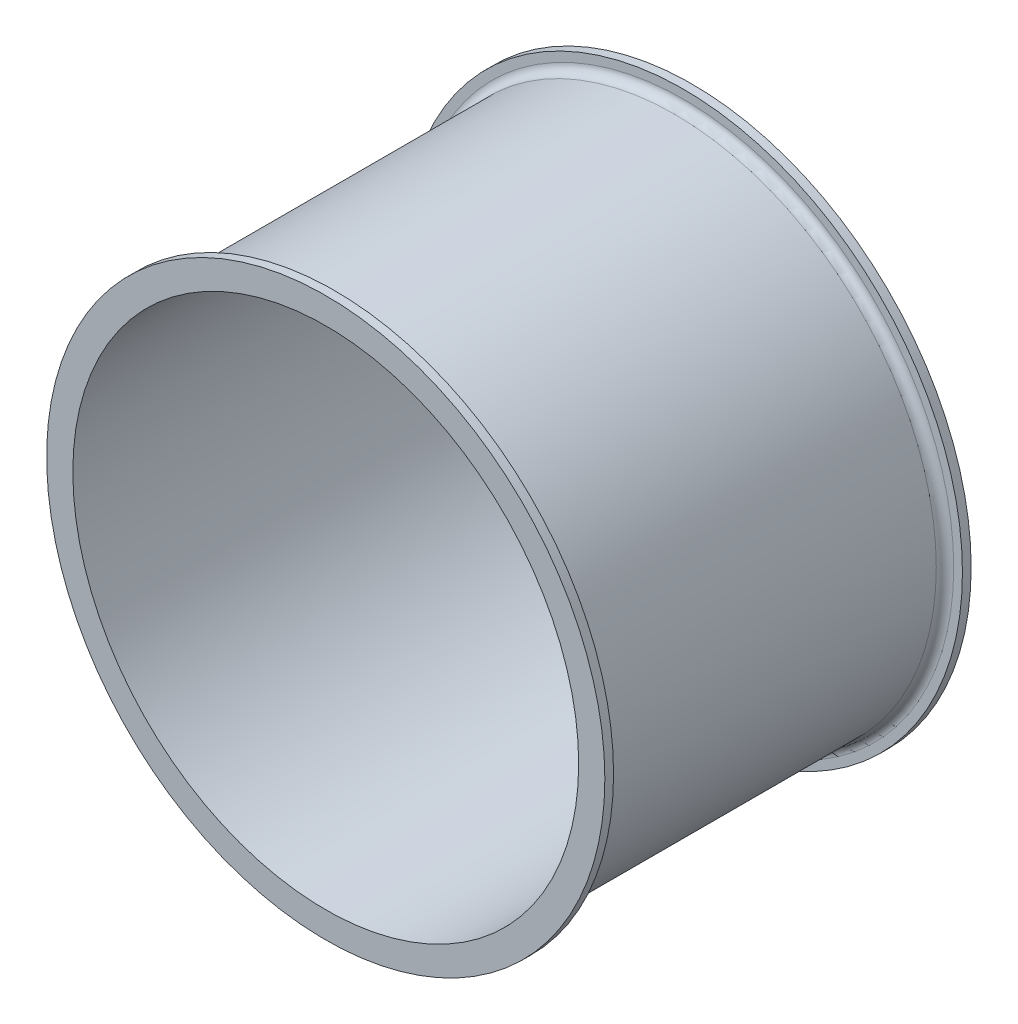
ISO-10303-21;
HEADER;
FILE_DESCRIPTION(('STEP AP214'),'2;1');
FILE_NAME('part.step','',(''),(''),'','','');
FILE_SCHEMA(('AUTOMOTIVE_DESIGN { 1 0 10303 214 1 1 1 1 }'));
ENDSEC;
DATA;
#1=APPLICATION_CONTEXT('core data for automotive mechanical design processes');
#2=APPLICATION_PROTOCOL_DEFINITION('international standard','automotive_design',2000,#1);
#3=PRODUCT_CONTEXT('',#1,'mechanical');
#4=PRODUCT('Part','Part','',(#3));
#5=PRODUCT_RELATED_PRODUCT_CATEGORY('part','',(#4));
#6=PRODUCT_DEFINITION_FORMATION('','',#4);
#7=PRODUCT_DEFINITION_CONTEXT('part definition',#1,'design');
#8=PRODUCT_DEFINITION('design','',#6,#7);
#9=PRODUCT_DEFINITION_SHAPE('','',#8);
#10=(LENGTH_UNIT() NAMED_UNIT(*) SI_UNIT(.MILLI.,.METRE.));
#11=(NAMED_UNIT(*) PLANE_ANGLE_UNIT() SI_UNIT($,.RADIAN.));
#12=(NAMED_UNIT(*) SI_UNIT($,.STERADIAN.) SOLID_ANGLE_UNIT());
#13=UNCERTAINTY_MEASURE_WITH_UNIT(LENGTH_MEASURE(1.E-05),#10,'distance_accuracy_value','');
#14=(GEOMETRIC_REPRESENTATION_CONTEXT(3) GLOBAL_UNCERTAINTY_ASSIGNED_CONTEXT((#13)) GLOBAL_UNIT_ASSIGNED_CONTEXT((#10,
#11,#12)) REPRESENTATION_CONTEXT('',''));
#15=CARTESIAN_POINT('',(0.,0.,0.));
#16=DIRECTION('',(0.,0.,1.));
#17=DIRECTION('',(1.,0.,0.));
#18=AXIS2_PLACEMENT_3D('',#15,#16,#17);
#19=CARTESIAN_POINT('',(0.,0.,5.));
#20=DIRECTION('',(0.,0.,-1.));
#21=DIRECTION('',(-1.,0.,0.));
#22=AXIS2_PLACEMENT_3D('',#19,#20,#21);
#23=CYLINDRICAL_SURFACE('',#22,160.);
#24=CARTESIAN_POINT('',(0.,0.,5.));
#25=DIRECTION('',(0.,0.,1.));
#26=DIRECTION('',(1.,0.,0.));
#27=AXIS2_PLACEMENT_3D('',#24,#25,#26);
#28=CIRCLE('',#27,160.);
#29=CARTESIAN_POINT('',(160.,0.,5.));
#30=VERTEX_POINT('',#29);
#31=EDGE_CURVE('E50',#30,#30,#28,.T.);
#32=ORIENTED_EDGE('',*,*,#31,.F.);
#33=EDGE_LOOP('',(#32));
#34=FACE_BOUND('',#33,.T.);
#35=CARTESIAN_POINT('',(0.,0.,0.));
#36=DIRECTION('',(0.,0.,1.));
#37=DIRECTION('',(1.,0.,0.));
#38=AXIS2_PLACEMENT_3D('',#35,#36,#37);
#39=CIRCLE('',#38,160.);
#40=CARTESIAN_POINT('',(160.,0.,0.));
#41=VERTEX_POINT('',#40);
#42=EDGE_CURVE('E51',#41,#41,#39,.T.);
#43=ORIENTED_EDGE('',*,*,#42,.T.);
#44=EDGE_LOOP('',(#43));
#45=FACE_BOUND('',#44,.T.);
#46=ADVANCED_FACE('F30',(#34,#45),#23,.T.);
#47=CARTESIAN_POINT('',(0.,0.,5.));
#48=DIRECTION('',(0.,0.,1.));
#49=DIRECTION('',(1.,0.,0.));
#50=AXIS2_PLACEMENT_3D('',#47,#48,#49);
#51=PLANE('',#50);
#52=CARTESIAN_POINT('',(0.,0.,5.));
#53=DIRECTION('',(0.,0.,1.));
#54=DIRECTION('',(1.,0.,0.));
#55=AXIS2_PLACEMENT_3D('',#52,#53,#54);
#56=CIRCLE('',#55,155.);
#57=CARTESIAN_POINT('',(155.,0.,5.));
#58=VERTEX_POINT('',#57);
#59=EDGE_CURVE('E37',#58,#58,#56,.F.);
#60=ORIENTED_EDGE('',*,*,#59,.T.);
#61=EDGE_LOOP('',(#60));
#62=FACE_BOUND('',#61,.T.);
#63=ORIENTED_EDGE('',*,*,#31,.T.);
#64=EDGE_LOOP('',(#63));
#65=FACE_BOUND('',#64,.T.);
#66=ADVANCED_FACE('F84',(#62,#65),#51,.T.);
#67=CARTESIAN_POINT('',(0.,0.,0.));
#68=DIRECTION('',(0.,0.,1.));
#69=DIRECTION('',(1.,0.,0.));
#70=AXIS2_PLACEMENT_3D('',#67,#68,#69);
#71=PLANE('',#70);
#72=CARTESIAN_POINT('',(0.,0.,0.));
#73=DIRECTION('',(0.,0.,-1.));
#74=DIRECTION('',(-1.,0.,0.));
#75=AXIS2_PLACEMENT_3D('',#72,#73,#74);
#76=CIRCLE('',#75,145.);
#77=CARTESIAN_POINT('',(-145.,0.,0.));
#78=VERTEX_POINT('',#77);
#79=EDGE_CURVE('E63',#78,#78,#76,.T.);
#80=ORIENTED_EDGE('',*,*,#79,.F.);
#81=EDGE_LOOP('',(#80));
#82=FACE_BOUND('',#81,.T.);
#83=ORIENTED_EDGE('',*,*,#42,.F.);
#84=EDGE_LOOP('',(#83));
#85=FACE_BOUND('',#84,.T.);
#86=ADVANCED_FACE('F80',(#82,#85),#71,.F.);
#87=CARTESIAN_POINT('',(0.,0.,205.));
#88=DIRECTION('',(0.,0.,-1.));
#89=DIRECTION('',(-1.,0.,0.));
#90=AXIS2_PLACEMENT_3D('',#87,#88,#89);
#91=CYLINDRICAL_SURFACE('',#90,150.);
#92=CARTESIAN_POINT('',(0.,0.,10.));
#93=DIRECTION('',(0.,0.,1.));
#94=DIRECTION('',(1.,0.,0.));
#95=AXIS2_PLACEMENT_3D('',#92,#93,#94);
#96=CIRCLE('',#95,150.);
#97=CARTESIAN_POINT('',(150.,0.,10.));
#98=VERTEX_POINT('',#97);
#99=EDGE_CURVE('E41',#98,#98,#96,.T.);
#100=ORIENTED_EDGE('',*,*,#99,.T.);
#101=EDGE_LOOP('',(#100));
#102=FACE_BOUND('',#101,.T.);
#103=CARTESIAN_POINT('',(0.,0.,200.));
#104=DIRECTION('',(0.,0.,1.));
#105=DIRECTION('',(1.,0.,0.));
#106=AXIS2_PLACEMENT_3D('',#103,#104,#105);
#107=CIRCLE('',#106,150.);
#108=CARTESIAN_POINT('',(150.,0.,200.));
#109=VERTEX_POINT('',#108);
#110=EDGE_CURVE('E45',#109,#109,#107,.F.);
#111=ORIENTED_EDGE('',*,*,#110,.T.);
#112=EDGE_LOOP('',(#111));
#113=FACE_BOUND('',#112,.T.);
#114=ADVANCED_FACE('F83',(#102,#113),#91,.T.);
#115=CARTESIAN_POINT('',(0.,0.,210.));
#116=DIRECTION('',(0.,0.,-1.));
#117=DIRECTION('',(-1.,0.,0.));
#118=AXIS2_PLACEMENT_3D('',#115,#116,#117);
#119=CYLINDRICAL_SURFACE('',#118,160.);
#120=CARTESIAN_POINT('',(0.,0.,210.));
#121=DIRECTION('',(0.,0.,1.));
#122=DIRECTION('',(1.,0.,0.));
#123=AXIS2_PLACEMENT_3D('',#120,#121,#122);
#124=CIRCLE('',#123,160.);
#125=CARTESIAN_POINT('',(160.,0.,210.));
#126=VERTEX_POINT('',#125);
#127=EDGE_CURVE('E54',#126,#126,#124,.T.);
#128=ORIENTED_EDGE('',*,*,#127,.F.);
#129=EDGE_LOOP('',(#128));
#130=FACE_BOUND('',#129,.T.);
#131=CARTESIAN_POINT('',(0.,0.,205.));
#132=DIRECTION('',(0.,0.,1.));
#133=DIRECTION('',(1.,0.,0.));
#134=AXIS2_PLACEMENT_3D('',#131,#132,#133);
#135=CIRCLE('',#134,160.);
#136=CARTESIAN_POINT('',(160.,0.,205.));
#137=VERTEX_POINT('',#136);
#138=EDGE_CURVE('E57',#137,#137,#135,.T.);
#139=ORIENTED_EDGE('',*,*,#138,.T.);
#140=EDGE_LOOP('',(#139));
#141=FACE_BOUND('',#140,.T.);
#142=ADVANCED_FACE('F107',(#130,#141),#119,.T.);
#143=CARTESIAN_POINT('',(0.,0.,210.));
#144=DIRECTION('',(0.,0.,1.));
#145=DIRECTION('',(1.,0.,0.));
#146=AXIS2_PLACEMENT_3D('',#143,#144,#145);
#147=PLANE('',#146);
#148=CARTESIAN_POINT('',(0.,0.,210.));
#149=DIRECTION('',(0.,0.,-1.));
#150=DIRECTION('',(-1.,0.,0.));
#151=AXIS2_PLACEMENT_3D('',#148,#149,#150);
#152=CIRCLE('',#151,145.);
#153=CARTESIAN_POINT('',(-145.,0.,210.));
#154=VERTEX_POINT('',#153);
#155=EDGE_CURVE('E60',#154,#154,#152,.T.);
#156=ORIENTED_EDGE('',*,*,#155,.T.);
#157=EDGE_LOOP('',(#156));
#158=FACE_BOUND('',#157,.T.);
#159=ORIENTED_EDGE('',*,*,#127,.T.);
#160=EDGE_LOOP('',(#159));
#161=FACE_BOUND('',#160,.T.);
#162=ADVANCED_FACE('F69',(#158,#161),#147,.T.);
#163=CARTESIAN_POINT('',(0.,0.,205.));
#164=DIRECTION('',(0.,0.,1.));
#165=DIRECTION('',(1.,0.,0.));
#166=AXIS2_PLACEMENT_3D('',#163,#164,#165);
#167=PLANE('',#166);
#168=CARTESIAN_POINT('',(0.,0.,205.));
#169=DIRECTION('',(0.,0.,1.));
#170=DIRECTION('',(1.,0.,0.));
#171=AXIS2_PLACEMENT_3D('',#168,#169,#170);
#172=CIRCLE('',#171,155.);
#173=CARTESIAN_POINT('',(155.,0.,205.));
#174=VERTEX_POINT('',#173);
#175=EDGE_CURVE('E10',#174,#174,#172,.T.);
#176=ORIENTED_EDGE('',*,*,#175,.T.);
#177=EDGE_LOOP('',(#176));
#178=FACE_BOUND('',#177,.T.);
#179=ORIENTED_EDGE('',*,*,#138,.F.);
#180=EDGE_LOOP('',(#179));
#181=FACE_BOUND('',#180,.T.);
#182=ADVANCED_FACE('F76',(#178,#181),#167,.F.);
#183=CARTESIAN_POINT('',(0.,0.,210.));
#184=DIRECTION('',(0.,0.,-1.));
#185=DIRECTION('',(-1.,0.,0.));
#186=AXIS2_PLACEMENT_3D('',#183,#184,#185);
#187=CYLINDRICAL_SURFACE('',#186,145.);
#188=ORIENTED_EDGE('',*,*,#155,.F.);
#189=EDGE_LOOP('',(#188));
#190=FACE_BOUND('',#189,.T.);
#191=ORIENTED_EDGE('',*,*,#79,.T.);
#192=EDGE_LOOP('',(#191));
#193=FACE_BOUND('',#192,.T.);
#194=ADVANCED_FACE('F72',(#190,#193),#187,.F.);
#195=CARTESIAN_POINT('',(0.,0.,10.));
#196=DIRECTION('',(0.,0.,1.));
#197=DIRECTION('',(1.,0.,0.));
#198=AXIS2_PLACEMENT_3D('',#195,#196,#197);
#199=TOROIDAL_SURFACE('',#198,155.,5.);
#200=ORIENTED_EDGE('',*,*,#59,.F.);
#201=EDGE_LOOP('',(#200));
#202=FACE_BOUND('',#201,.T.);
#203=ORIENTED_EDGE('',*,*,#99,.F.);
#204=EDGE_LOOP('',(#203));
#205=FACE_BOUND('',#204,.T.);
#206=ADVANCED_FACE('F75',(#202,#205),#199,.F.);
#207=CARTESIAN_POINT('',(0.,0.,200.));
#208=DIRECTION('',(0.,0.,1.));
#209=DIRECTION('',(1.,0.,0.));
#210=AXIS2_PLACEMENT_3D('',#207,#208,#209);
#211=TOROIDAL_SURFACE('',#210,155.,5.);
#212=ORIENTED_EDGE('',*,*,#110,.F.);
#213=EDGE_LOOP('',(#212));
#214=FACE_BOUND('',#213,.T.);
#215=ORIENTED_EDGE('',*,*,#175,.F.);
#216=EDGE_LOOP('',(#215));
#217=FACE_BOUND('',#216,.T.);
#218=ADVANCED_FACE('F32',(#214,#217),#211,.F.);
#219=CLOSED_SHELL('',(#46,#66,#86,#114,#142,#162,#182,#194,#206,#218));
#220=MANIFOLD_SOLID_BREP('B2',#219);
#221=ADVANCED_BREP_SHAPE_REPRESENTATION('',(#18,#220),#14);
#222=SHAPE_DEFINITION_REPRESENTATION(#9,#221);
ENDSEC;
END-ISO-10303-21;
